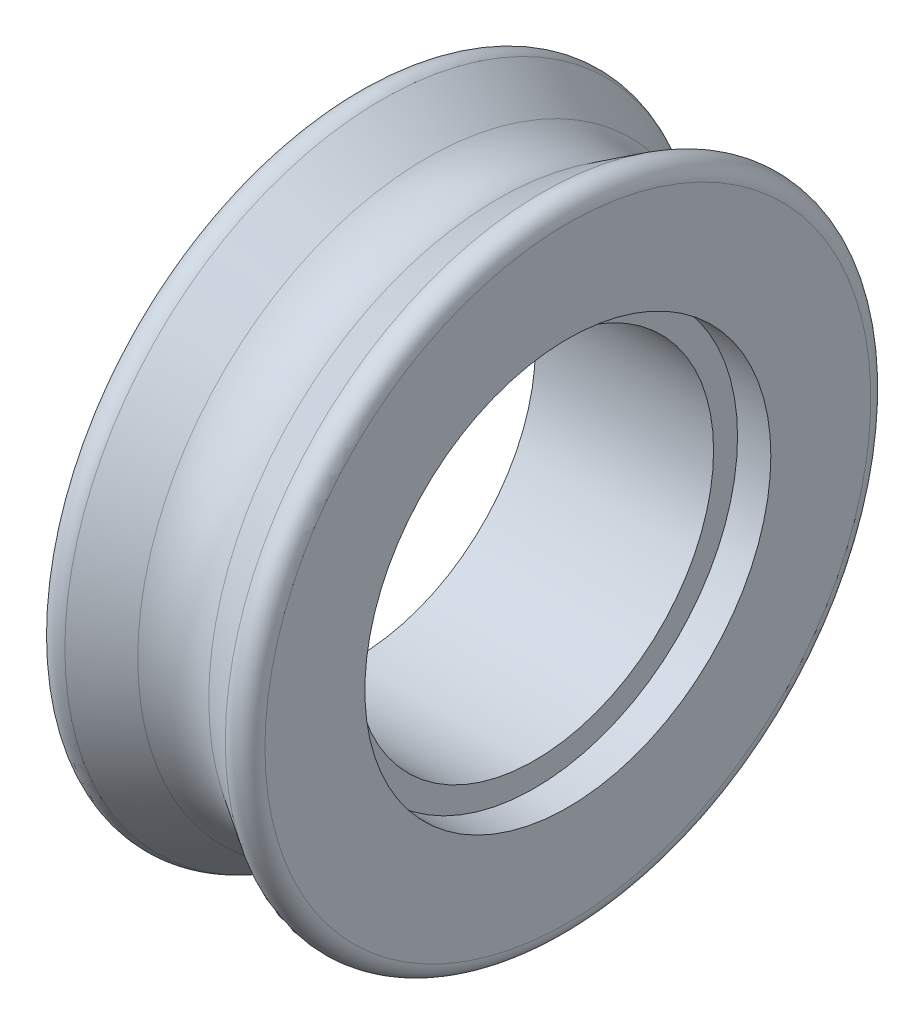
ISO-10303-21;
HEADER;
FILE_DESCRIPTION(('STEP AP214'),'2;1');
FILE_NAME('part.step','',(''),(''),'','','');
FILE_SCHEMA(('AUTOMOTIVE_DESIGN { 1 0 10303 214 1 1 1 1 }'));
ENDSEC;
DATA;
#1=APPLICATION_CONTEXT('core data for automotive mechanical design processes');
#2=APPLICATION_PROTOCOL_DEFINITION('international standard','automotive_design',2000,#1);
#3=PRODUCT_CONTEXT('',#1,'mechanical');
#4=PRODUCT('Part','Part','',(#3));
#5=PRODUCT_RELATED_PRODUCT_CATEGORY('part','',(#4));
#6=PRODUCT_DEFINITION_FORMATION('','',#4);
#7=PRODUCT_DEFINITION_CONTEXT('part definition',#1,'design');
#8=PRODUCT_DEFINITION('design','',#6,#7);
#9=PRODUCT_DEFINITION_SHAPE('','',#8);
#10=(LENGTH_UNIT() NAMED_UNIT(*) SI_UNIT(.MILLI.,.METRE.));
#11=(NAMED_UNIT(*) PLANE_ANGLE_UNIT() SI_UNIT($,.RADIAN.));
#12=(NAMED_UNIT(*) SI_UNIT($,.STERADIAN.) SOLID_ANGLE_UNIT());
#13=UNCERTAINTY_MEASURE_WITH_UNIT(LENGTH_MEASURE(1.E-05),#10,'distance_accuracy_value','');
#14=(GEOMETRIC_REPRESENTATION_CONTEXT(3) GLOBAL_UNCERTAINTY_ASSIGNED_CONTEXT((#13)) GLOBAL_UNIT_ASSIGNED_CONTEXT((#10,
#11,#12)) REPRESENTATION_CONTEXT('',''));
#15=CARTESIAN_POINT('',(0.,0.,0.));
#16=DIRECTION('',(0.,0.,1.));
#17=DIRECTION('',(1.,0.,0.));
#18=AXIS2_PLACEMENT_3D('',#15,#16,#17);
#19=CARTESIAN_POINT('',(6.35,0.,0.));
#20=DIRECTION('',(-1.,0.,0.));
#21=DIRECTION('',(0.,0.,1.));
#22=AXIS2_PLACEMENT_3D('',#19,#20,#21);
#23=PLANE('',#22);
#24=CARTESIAN_POINT('',(6.35,0.,0.));
#25=DIRECTION('',(1.,0.,0.));
#26=DIRECTION('',(0.,0.,-1.));
#27=AXIS2_PLACEMENT_3D('',#24,#25,#26);
#28=CIRCLE('',#27,6.09410773410009);
#29=CARTESIAN_POINT('',(6.35,0.,-6.09410773410009));
#30=VERTEX_POINT('',#29);
#31=EDGE_CURVE('E61',#30,#30,#28,.T.);
#32=ORIENTED_EDGE('',*,*,#31,.F.);
#33=EDGE_LOOP('',(#32));
#34=FACE_BOUND('',#33,.T.);
#35=CARTESIAN_POINT('',(6.35,0.,0.));
#36=DIRECTION('',(-1.,0.,0.));
#37=DIRECTION('',(0.,0.,1.));
#38=AXIS2_PLACEMENT_3D('',#35,#36,#37);
#39=CIRCLE('',#38,9.09410773410009);
#40=CARTESIAN_POINT('',(6.35,0.,9.09410773410009));
#41=VERTEX_POINT('',#40);
#42=EDGE_CURVE('E54',#41,#41,#39,.F.);
#43=ORIENTED_EDGE('',*,*,#42,.T.);
#44=EDGE_LOOP('',(#43));
#45=FACE_BOUND('',#44,.T.);
#46=ADVANCED_FACE('F34',(#34,#45),#23,.F.);
#47=CARTESIAN_POINT('',(6.35,0.,0.));
#48=DIRECTION('',(1.,0.,0.));
#49=DIRECTION('',(0.,0.,-1.));
#50=AXIS2_PLACEMENT_3D('',#47,#48,#49);
#51=CONICAL_SURFACE('',#50,10.,0.562130374114294);
#52=CARTESIAN_POINT('',(4.24097992304018,0.,0.));
#53=DIRECTION('',(-1.,0.,0.));
#54=DIRECTION('',(0.,0.,1.));
#55=AXIS2_PLACEMENT_3D('',#52,#53,#54);
#56=CIRCLE('',#55,8.6714834160883);
#57=CARTESIAN_POINT('',(4.24097992304018,0.,8.6714834160883));
#58=VERTEX_POINT('',#57);
#59=EDGE_CURVE('E10',#58,#58,#56,.F.);
#60=ORIENTED_EDGE('',*,*,#59,.T.);
#61=EDGE_LOOP('',(#60));
#62=FACE_BOUND('',#61,.T.);
#63=CARTESIAN_POINT('',(5.58350501923995,0.,0.));
#64=DIRECTION('',(-1.,0.,0.));
#65=DIRECTION('',(0.,0.,1.));
#66=AXIS2_PLACEMENT_3D('',#63,#64,#65);
#67=CIRCLE('',#66,9.51716851605666);
#68=CARTESIAN_POINT('',(5.58350501923995,0.,9.51716851605666));
#69=VERTEX_POINT('',#68);
#70=EDGE_CURVE('E57',#69,#69,#67,.T.);
#71=ORIENTED_EDGE('',*,*,#70,.T.);
#72=EDGE_LOOP('',(#71));
#73=FACE_BOUND('',#72,.T.);
#74=ADVANCED_FACE('F96',(#62,#73),#51,.T.);
#75=CARTESIAN_POINT('',(0.,0.,0.));
#76=DIRECTION('',(-1.,0.,0.));
#77=DIRECTION('',(0.,0.,1.));
#78=AXIS2_PLACEMENT_3D('',#75,#76,#77);
#79=CONICAL_SURFACE('',#78,10.,0.562130374114294);
#80=CARTESIAN_POINT('',(2.10902007695982,0.,0.));
#81=DIRECTION('',(1.,0.,0.));
#82=DIRECTION('',(0.,0.,-1.));
#83=AXIS2_PLACEMENT_3D('',#80,#81,#82);
#84=CIRCLE('',#83,8.6714834160883);
#85=CARTESIAN_POINT('',(2.10902007695982,0.,-8.6714834160883));
#86=VERTEX_POINT('',#85);
#87=EDGE_CURVE('E41',#86,#86,#84,.F.);
#88=ORIENTED_EDGE('',*,*,#87,.T.);
#89=EDGE_LOOP('',(#88));
#90=FACE_BOUND('',#89,.T.);
#91=CARTESIAN_POINT('',(0.766494980760042,0.,0.));
#92=DIRECTION('',(1.,0.,0.));
#93=DIRECTION('',(0.,0.,-1.));
#94=AXIS2_PLACEMENT_3D('',#91,#92,#93);
#95=CIRCLE('',#94,9.51716851605667);
#96=CARTESIAN_POINT('',(0.766494980760042,0.,-9.51716851605667));
#97=VERTEX_POINT('',#96);
#98=EDGE_CURVE('E45',#97,#97,#95,.T.);
#99=ORIENTED_EDGE('',*,*,#98,.T.);
#100=EDGE_LOOP('',(#99));
#101=FACE_BOUND('',#100,.T.);
#102=ADVANCED_FACE('F108',(#90,#101),#79,.T.);
#103=CARTESIAN_POINT('',(0.,0.,0.));
#104=DIRECTION('',(-1.,0.,0.));
#105=DIRECTION('',(0.,0.,1.));
#106=AXIS2_PLACEMENT_3D('',#103,#104,#105);
#107=PLANE('',#106);
#108=CARTESIAN_POINT('',(0.,0.,0.));
#109=DIRECTION('',(1.,0.,0.));
#110=DIRECTION('',(0.,0.,-1.));
#111=AXIS2_PLACEMENT_3D('',#108,#109,#110);
#112=CIRCLE('',#111,5.375);
#113=CARTESIAN_POINT('',(0.,0.,-5.375));
#114=VERTEX_POINT('',#113);
#115=EDGE_CURVE('E64',#114,#114,#112,.T.);
#116=ORIENTED_EDGE('',*,*,#115,.T.);
#117=EDGE_LOOP('',(#116));
#118=FACE_BOUND('',#117,.T.);
#119=CARTESIAN_POINT('',(0.,0.,0.));
#120=DIRECTION('',(-1.,0.,0.));
#121=DIRECTION('',(0.,0.,1.));
#122=AXIS2_PLACEMENT_3D('',#119,#120,#121);
#123=CIRCLE('',#122,9.09410773410009);
#124=CARTESIAN_POINT('',(0.,0.,9.09410773410009));
#125=VERTEX_POINT('',#124);
#126=EDGE_CURVE('E49',#125,#125,#123,.T.);
#127=ORIENTED_EDGE('',*,*,#126,.T.);
#128=EDGE_LOOP('',(#127));
#129=FACE_BOUND('',#128,.T.);
#130=ADVANCED_FACE('F73',(#118,#129),#107,.T.);
#131=CARTESIAN_POINT('',(5.85,0.,0.));
#132=DIRECTION('',(-1.,0.,0.));
#133=DIRECTION('',(0.,0.,1.));
#134=AXIS2_PLACEMENT_3D('',#131,#132,#133);
#135=TOROIDAL_SURFACE('',#134,9.09410773410009,0.5);
#136=ORIENTED_EDGE('',*,*,#42,.F.);
#137=EDGE_LOOP('',(#136));
#138=FACE_BOUND('',#137,.T.);
#139=ORIENTED_EDGE('',*,*,#70,.F.);
#140=EDGE_LOOP('',(#139));
#141=FACE_BOUND('',#140,.T.);
#142=ADVANCED_FACE('F100',(#138,#141),#135,.T.);
#143=CARTESIAN_POINT('',(0.5,0.,0.));
#144=DIRECTION('',(-1.,0.,0.));
#145=DIRECTION('',(0.,0.,1.));
#146=AXIS2_PLACEMENT_3D('',#143,#144,#145);
#147=TOROIDAL_SURFACE('',#146,9.09410773410009,0.5);
#148=ORIENTED_EDGE('',*,*,#98,.F.);
#149=EDGE_LOOP('',(#148));
#150=FACE_BOUND('',#149,.T.);
#151=ORIENTED_EDGE('',*,*,#126,.F.);
#152=EDGE_LOOP('',(#151));
#153=FACE_BOUND('',#152,.T.);
#154=ADVANCED_FACE('F103',(#150,#153),#147,.T.);
#155=CARTESIAN_POINT('',(3.175,0.,0.));
#156=DIRECTION('',(-1.,0.,0.));
#157=DIRECTION('',(0.,0.,1.));
#158=AXIS2_PLACEMENT_3D('',#155,#156,#157);
#159=TOROIDAL_SURFACE('',#158,10.3637265439146,2.);
#160=ORIENTED_EDGE('',*,*,#59,.F.);
#161=EDGE_LOOP('',(#160));
#162=FACE_BOUND('',#161,.T.);
#163=ORIENTED_EDGE('',*,*,#87,.F.);
#164=EDGE_LOOP('',(#163));
#165=FACE_BOUND('',#164,.T.);
#166=ADVANCED_FACE('F36',(#162,#165),#159,.F.);
#167=CARTESIAN_POINT('',(5.35,0.,0.));
#168=DIRECTION('',(1.,0.,0.));
#169=DIRECTION('',(0.,0.,-1.));
#170=AXIS2_PLACEMENT_3D('',#167,#168,#169);
#171=CYLINDRICAL_SURFACE('',#170,6.09410773410009);
#172=CARTESIAN_POINT('',(5.35,0.,0.));
#173=DIRECTION('',(1.,0.,0.));
#174=DIRECTION('',(0.,0.,-1.));
#175=AXIS2_PLACEMENT_3D('',#172,#173,#174);
#176=CIRCLE('',#175,6.09410773410009);
#177=CARTESIAN_POINT('',(5.35,0.,-6.09410773410009));
#178=VERTEX_POINT('',#177);
#179=EDGE_CURVE('E60',#178,#178,#176,.T.);
#180=ORIENTED_EDGE('',*,*,#179,.F.);
#181=EDGE_LOOP('',(#180));
#182=FACE_BOUND('',#181,.T.);
#183=ORIENTED_EDGE('',*,*,#31,.T.);
#184=EDGE_LOOP('',(#183));
#185=FACE_BOUND('',#184,.T.);
#186=ADVANCED_FACE('F85',(#182,#185),#171,.F.);
#187=CARTESIAN_POINT('',(5.35,0.,0.));
#188=DIRECTION('',(1.,0.,0.));
#189=DIRECTION('',(0.,0.,-1.));
#190=AXIS2_PLACEMENT_3D('',#187,#188,#189);
#191=PLANE('',#190);
#192=CARTESIAN_POINT('',(5.35,0.,0.));
#193=DIRECTION('',(1.,0.,0.));
#194=DIRECTION('',(0.,0.,-1.));
#195=AXIS2_PLACEMENT_3D('',#192,#193,#194);
#196=CIRCLE('',#195,5.375);
#197=CARTESIAN_POINT('',(5.35,0.,-5.375));
#198=VERTEX_POINT('',#197);
#199=EDGE_CURVE('E67',#198,#198,#196,.T.);
#200=ORIENTED_EDGE('',*,*,#199,.F.);
#201=EDGE_LOOP('',(#200));
#202=FACE_BOUND('',#201,.T.);
#203=ORIENTED_EDGE('',*,*,#179,.T.);
#204=EDGE_LOOP('',(#203));
#205=FACE_BOUND('',#204,.T.);
#206=ADVANCED_FACE('F79',(#202,#205),#191,.T.);
#207=CARTESIAN_POINT('',(0.,0.,0.));
#208=DIRECTION('',(1.,0.,0.));
#209=DIRECTION('',(0.,0.,-1.));
#210=AXIS2_PLACEMENT_3D('',#207,#208,#209);
#211=CYLINDRICAL_SURFACE('',#210,5.375);
#212=ORIENTED_EDGE('',*,*,#115,.F.);
#213=EDGE_LOOP('',(#212));
#214=FACE_BOUND('',#213,.T.);
#215=ORIENTED_EDGE('',*,*,#199,.T.);
#216=EDGE_LOOP('',(#215));
#217=FACE_BOUND('',#216,.T.);
#218=ADVANCED_FACE('F76',(#214,#217),#211,.F.);
#219=CLOSED_SHELL('',(#46,#74,#102,#130,#142,#154,#166,#186,#206,#218));
#220=MANIFOLD_SOLID_BREP('B2',#219);
#221=ADVANCED_BREP_SHAPE_REPRESENTATION('',(#18,#220),#14);
#222=SHAPE_DEFINITION_REPRESENTATION(#9,#221);
ENDSEC;
END-ISO-10303-21;
